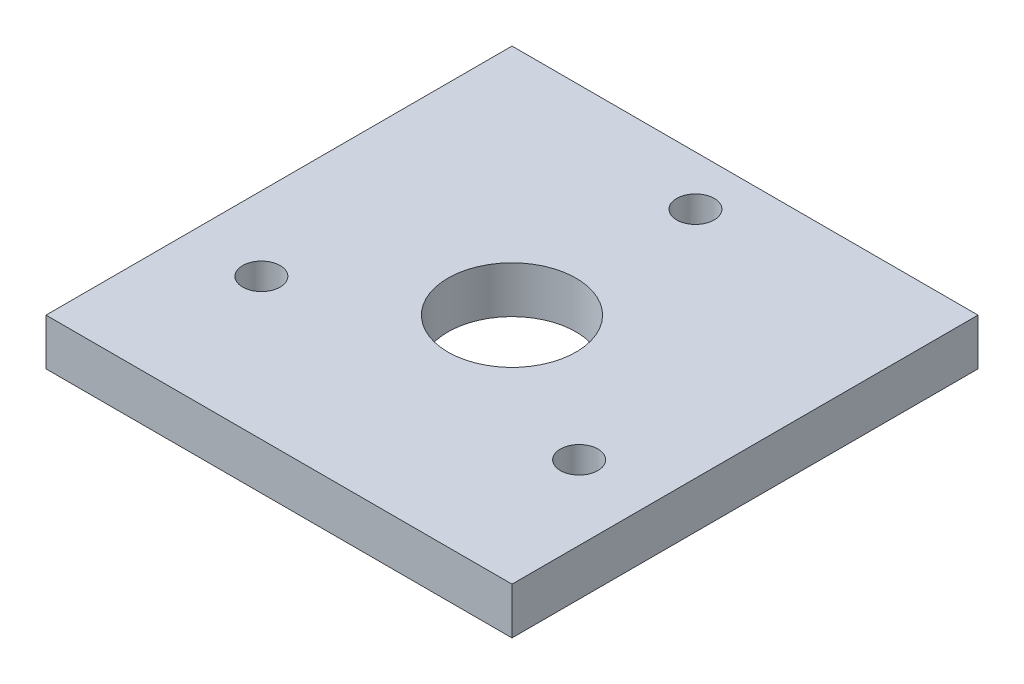
ISO-10303-21;
HEADER;
FILE_DESCRIPTION(('STEP AP214'),'2;1');
FILE_NAME('part.step','',(''),(''),'','','');
FILE_SCHEMA(('AUTOMOTIVE_DESIGN { 1 0 10303 214 1 1 1 1 }'));
ENDSEC;
DATA;
#1=APPLICATION_CONTEXT('core data for automotive mechanical design processes');
#2=APPLICATION_PROTOCOL_DEFINITION('international standard','automotive_design',2000,#1);
#3=PRODUCT_CONTEXT('',#1,'mechanical');
#4=PRODUCT('Part','Part','',(#3));
#5=PRODUCT_RELATED_PRODUCT_CATEGORY('part','',(#4));
#6=PRODUCT_DEFINITION_FORMATION('','',#4);
#7=PRODUCT_DEFINITION_CONTEXT('part definition',#1,'design');
#8=PRODUCT_DEFINITION('design','',#6,#7);
#9=PRODUCT_DEFINITION_SHAPE('','',#8);
#10=(LENGTH_UNIT() NAMED_UNIT(*) SI_UNIT(.MILLI.,.METRE.));
#11=(NAMED_UNIT(*) PLANE_ANGLE_UNIT() SI_UNIT($,.RADIAN.));
#12=(NAMED_UNIT(*) SI_UNIT($,.STERADIAN.) SOLID_ANGLE_UNIT());
#13=UNCERTAINTY_MEASURE_WITH_UNIT(LENGTH_MEASURE(1.E-05),#10,'distance_accuracy_value','');
#14=(GEOMETRIC_REPRESENTATION_CONTEXT(3) GLOBAL_UNCERTAINTY_ASSIGNED_CONTEXT((#13)) GLOBAL_UNIT_ASSIGNED_CONTEXT((#10,
#11,#12)) REPRESENTATION_CONTEXT('',''));
#15=CARTESIAN_POINT('',(0.,0.,0.));
#16=DIRECTION('',(0.,0.,1.));
#17=DIRECTION('',(1.,0.,0.));
#18=AXIS2_PLACEMENT_3D('',#15,#16,#17);
#19=CARTESIAN_POINT('',(0.,6.35,0.));
#20=DIRECTION('',(0.,1.,0.));
#21=DIRECTION('',(0.,0.,1.));
#22=AXIS2_PLACEMENT_3D('',#19,#20,#21);
#23=PLANE('',#22);
#24=CARTESIAN_POINT('',(21.6506350946126,6.35,12.4999999999991));
#25=DIRECTION('',(0.,1.,0.));
#26=DIRECTION('',(0.,0.,1.));
#27=AXIS2_PLACEMENT_3D('',#24,#25,#26);
#28=CIRCLE('',#27,2.55270000000138);
#29=CARTESIAN_POINT('',(21.6506350946126,6.35,15.0527000000005));
#30=VERTEX_POINT('',#29);
#31=EDGE_CURVE('E121',#30,#30,#28,.T.);
#32=ORIENTED_EDGE('',*,*,#31,.F.);
#33=EDGE_LOOP('',(#32));
#34=FACE_BOUND('',#33,.T.);
#35=CARTESIAN_POINT('',(0.,6.35,-25.));
#36=DIRECTION('',(0.,1.,0.));
#37=DIRECTION('',(0.,0.,1.));
#38=AXIS2_PLACEMENT_3D('',#35,#36,#37);
#39=CIRCLE('',#38,2.5527);
#40=CARTESIAN_POINT('',(0.,6.35,-22.4473));
#41=VERTEX_POINT('',#40);
#42=EDGE_CURVE('E100',#41,#41,#39,.T.);
#43=ORIENTED_EDGE('',*,*,#42,.F.);
#44=EDGE_LOOP('',(#43));
#45=FACE_BOUND('',#44,.T.);
#46=DIRECTION('',(0.,0.,1.));
#47=VECTOR('',#46,1.);
#48=CARTESIAN_POINT('',(-31.75,6.35,31.75));
#49=LINE('',#48,#47);
#50=CARTESIAN_POINT('',(-31.75,6.35,-31.75));
#51=VERTEX_POINT('',#50);
#52=CARTESIAN_POINT('',(-31.75,6.35,31.75));
#53=VERTEX_POINT('',#52);
#54=EDGE_CURVE('E85',#51,#53,#49,.T.);
#55=ORIENTED_EDGE('',*,*,#54,.T.);
#56=DIRECTION('',(1.,0.,0.));
#57=VECTOR('',#56,1.);
#58=CARTESIAN_POINT('',(31.75,6.35,31.75));
#59=LINE('',#58,#57);
#60=CARTESIAN_POINT('',(31.75,6.35,31.75));
#61=VERTEX_POINT('',#60);
#62=EDGE_CURVE('E80',#53,#61,#59,.T.);
#63=ORIENTED_EDGE('',*,*,#62,.T.);
#64=DIRECTION('',(0.,0.,-1.));
#65=VECTOR('',#64,1.);
#66=CARTESIAN_POINT('',(31.75,6.35,31.75));
#67=LINE('',#66,#65);
#68=CARTESIAN_POINT('',(31.75,6.35,-31.75));
#69=VERTEX_POINT('',#68);
#70=EDGE_CURVE('E83',#61,#69,#67,.T.);
#71=ORIENTED_EDGE('',*,*,#70,.T.);
#72=DIRECTION('',(-1.,0.,0.));
#73=VECTOR('',#72,1.);
#74=CARTESIAN_POINT('',(31.75,6.35,-31.75));
#75=LINE('',#74,#73);
#76=EDGE_CURVE('E50',#69,#51,#75,.T.);
#77=ORIENTED_EDGE('',*,*,#76,.T.);
#78=EDGE_LOOP('',(#55,#63,#71,#77));
#79=FACE_BOUND('',#78,.T.);
#80=CARTESIAN_POINT('',(0.,6.35,0.));
#81=DIRECTION('',(0.,1.,0.));
#82=DIRECTION('',(0.,0.,1.));
#83=AXIS2_PLACEMENT_3D('',#80,#81,#82);
#84=CIRCLE('',#83,8.73125);
#85=CARTESIAN_POINT('',(0.,6.35,8.73125000000001));
#86=VERTEX_POINT('',#85);
#87=EDGE_CURVE('E115',#86,#86,#84,.T.);
#88=ORIENTED_EDGE('',*,*,#87,.F.);
#89=EDGE_LOOP('',(#88));
#90=FACE_BOUND('',#89,.T.);
#91=CARTESIAN_POINT('',(-21.6506350946094,6.35,12.5000000000009));
#92=DIRECTION('',(0.,1.,0.));
#93=DIRECTION('',(0.,0.,1.));
#94=AXIS2_PLACEMENT_3D('',#91,#92,#93);
#95=CIRCLE('',#94,2.55270000000203);
#96=CARTESIAN_POINT('',(-21.6506350946094,6.35,15.052700000003));
#97=VERTEX_POINT('',#96);
#98=EDGE_CURVE('E127',#97,#97,#95,.T.);
#99=ORIENTED_EDGE('',*,*,#98,.F.);
#100=EDGE_LOOP('',(#99));
#101=FACE_BOUND('',#100,.T.);
#102=ADVANCED_FACE('F33',(#34,#45,#79,#90,#101),#23,.T.);
#103=CARTESIAN_POINT('',(0.,0.,0.));
#104=DIRECTION('',(0.,1.,0.));
#105=DIRECTION('',(0.,0.,1.));
#106=AXIS2_PLACEMENT_3D('',#103,#104,#105);
#107=PLANE('',#106);
#108=DIRECTION('',(0.,0.,1.));
#109=VECTOR('',#108,1.);
#110=CARTESIAN_POINT('',(-31.75,0.,31.75));
#111=LINE('',#110,#109);
#112=CARTESIAN_POINT('',(-31.75,0.,-31.75));
#113=VERTEX_POINT('',#112);
#114=CARTESIAN_POINT('',(-31.75,0.,31.75));
#115=VERTEX_POINT('',#114);
#116=EDGE_CURVE('E97',#113,#115,#111,.T.);
#117=ORIENTED_EDGE('',*,*,#116,.F.);
#118=DIRECTION('',(-1.,0.,0.));
#119=VECTOR('',#118,1.);
#120=CARTESIAN_POINT('',(31.75,0.,-31.75));
#121=LINE('',#120,#119);
#122=CARTESIAN_POINT('',(31.75,0.,-31.75));
#123=VERTEX_POINT('',#122);
#124=EDGE_CURVE('E73',#123,#113,#121,.T.);
#125=ORIENTED_EDGE('',*,*,#124,.F.);
#126=DIRECTION('',(0.,0.,-1.));
#127=VECTOR('',#126,1.);
#128=CARTESIAN_POINT('',(31.75,0.,31.75));
#129=LINE('',#128,#127);
#130=CARTESIAN_POINT('',(31.75,0.,31.75));
#131=VERTEX_POINT('',#130);
#132=EDGE_CURVE('E67',#131,#123,#129,.T.);
#133=ORIENTED_EDGE('',*,*,#132,.F.);
#134=DIRECTION('',(1.,0.,0.));
#135=VECTOR('',#134,1.);
#136=CARTESIAN_POINT('',(31.75,0.,31.75));
#137=LINE('',#136,#135);
#138=EDGE_CURVE('E89',#115,#131,#137,.T.);
#139=ORIENTED_EDGE('',*,*,#138,.F.);
#140=EDGE_LOOP('',(#117,#125,#133,#139));
#141=FACE_BOUND('',#140,.T.);
#142=CARTESIAN_POINT('',(0.,0.,-25.));
#143=DIRECTION('',(0.,1.,0.));
#144=DIRECTION('',(0.,0.,1.));
#145=AXIS2_PLACEMENT_3D('',#142,#143,#144);
#146=CIRCLE('',#145,2.5527);
#147=CARTESIAN_POINT('',(0.,0.,-22.4473));
#148=VERTEX_POINT('',#147);
#149=EDGE_CURVE('E112',#148,#148,#146,.T.);
#150=ORIENTED_EDGE('',*,*,#149,.T.);
#151=EDGE_LOOP('',(#150));
#152=FACE_BOUND('',#151,.T.);
#153=CARTESIAN_POINT('',(0.,0.,0.));
#154=DIRECTION('',(0.,1.,0.));
#155=DIRECTION('',(0.,0.,1.));
#156=AXIS2_PLACEMENT_3D('',#153,#154,#155);
#157=CIRCLE('',#156,8.73125);
#158=CARTESIAN_POINT('',(0.,0.,8.73125000000001));
#159=VERTEX_POINT('',#158);
#160=EDGE_CURVE('E118',#159,#159,#157,.T.);
#161=ORIENTED_EDGE('',*,*,#160,.T.);
#162=EDGE_LOOP('',(#161));
#163=FACE_BOUND('',#162,.T.);
#164=CARTESIAN_POINT('',(21.6506350946126,0.,12.4999999999991));
#165=DIRECTION('',(0.,1.,0.));
#166=DIRECTION('',(0.,0.,1.));
#167=AXIS2_PLACEMENT_3D('',#164,#165,#166);
#168=CIRCLE('',#167,2.55270000000138);
#169=CARTESIAN_POINT('',(21.6506350946126,0.,15.0527000000005));
#170=VERTEX_POINT('',#169);
#171=EDGE_CURVE('E124',#170,#170,#168,.T.);
#172=ORIENTED_EDGE('',*,*,#171,.T.);
#173=EDGE_LOOP('',(#172));
#174=FACE_BOUND('',#173,.T.);
#175=CARTESIAN_POINT('',(-21.6506350946094,0.,12.5000000000009));
#176=DIRECTION('',(0.,1.,0.));
#177=DIRECTION('',(0.,0.,1.));
#178=AXIS2_PLACEMENT_3D('',#175,#176,#177);
#179=CIRCLE('',#178,2.55270000000203);
#180=CARTESIAN_POINT('',(-21.6506350946094,0.,15.052700000003));
#181=VERTEX_POINT('',#180);
#182=EDGE_CURVE('E130',#181,#181,#179,.T.);
#183=ORIENTED_EDGE('',*,*,#182,.T.);
#184=EDGE_LOOP('',(#183));
#185=FACE_BOUND('',#184,.T.);
#186=ADVANCED_FACE('F108',(#141,#152,#163,#174,#185),#107,.F.);
#187=CARTESIAN_POINT('',(-31.75,6.35,31.75));
#188=DIRECTION('',(1.,0.,0.));
#189=DIRECTION('',(0.,0.,-1.));
#190=AXIS2_PLACEMENT_3D('',#187,#188,#189);
#191=PLANE('',#190);
#192=ORIENTED_EDGE('',*,*,#116,.T.);
#193=DIRECTION('',(0.,-1.,0.));
#194=VECTOR('',#193,1.);
#195=CARTESIAN_POINT('',(-31.75,6.35,31.75));
#196=LINE('',#195,#194);
#197=EDGE_CURVE('E11',#53,#115,#196,.T.);
#198=ORIENTED_EDGE('',*,*,#197,.F.);
#199=ORIENTED_EDGE('',*,*,#54,.F.);
#200=DIRECTION('',(0.,-1.,0.));
#201=VECTOR('',#200,1.);
#202=CARTESIAN_POINT('',(-31.75,6.35,-31.75));
#203=LINE('',#202,#201);
#204=EDGE_CURVE('E93',#51,#113,#203,.T.);
#205=ORIENTED_EDGE('',*,*,#204,.T.);
#206=EDGE_LOOP('',(#192,#198,#199,#205));
#207=FACE_BOUND('',#206,.T.);
#208=ADVANCED_FACE('F35',(#207),#191,.F.);
#209=CARTESIAN_POINT('',(31.75,6.35,31.75));
#210=DIRECTION('',(0.,0.,-1.));
#211=DIRECTION('',(-1.,0.,0.));
#212=AXIS2_PLACEMENT_3D('',#209,#210,#211);
#213=PLANE('',#212);
#214=ORIENTED_EDGE('',*,*,#138,.T.);
#215=DIRECTION('',(0.,-1.,0.));
#216=VECTOR('',#215,1.);
#217=CARTESIAN_POINT('',(31.75,6.35,31.75));
#218=LINE('',#217,#216);
#219=EDGE_CURVE('E42',#61,#131,#218,.T.);
#220=ORIENTED_EDGE('',*,*,#219,.F.);
#221=ORIENTED_EDGE('',*,*,#62,.F.);
#222=ORIENTED_EDGE('',*,*,#197,.T.);
#223=EDGE_LOOP('',(#214,#220,#221,#222));
#224=FACE_BOUND('',#223,.T.);
#225=ADVANCED_FACE('F88',(#224),#213,.F.);
#226=CARTESIAN_POINT('',(31.75,6.35,31.75));
#227=DIRECTION('',(-1.,0.,0.));
#228=DIRECTION('',(0.,0.,1.));
#229=AXIS2_PLACEMENT_3D('',#226,#227,#228);
#230=PLANE('',#229);
#231=ORIENTED_EDGE('',*,*,#132,.T.);
#232=DIRECTION('',(0.,-1.,0.));
#233=VECTOR('',#232,1.);
#234=CARTESIAN_POINT('',(31.75,6.35,-31.75));
#235=LINE('',#234,#233);
#236=EDGE_CURVE('E90',#69,#123,#235,.T.);
#237=ORIENTED_EDGE('',*,*,#236,.F.);
#238=ORIENTED_EDGE('',*,*,#70,.F.);
#239=ORIENTED_EDGE('',*,*,#219,.T.);
#240=EDGE_LOOP('',(#231,#237,#238,#239));
#241=FACE_BOUND('',#240,.T.);
#242=ADVANCED_FACE('F91',(#241),#230,.F.);
#243=CARTESIAN_POINT('',(31.75,6.35,-31.75));
#244=DIRECTION('',(0.,0.,1.));
#245=DIRECTION('',(1.,0.,0.));
#246=AXIS2_PLACEMENT_3D('',#243,#244,#245);
#247=PLANE('',#246);
#248=ORIENTED_EDGE('',*,*,#124,.T.);
#249=ORIENTED_EDGE('',*,*,#204,.F.);
#250=ORIENTED_EDGE('',*,*,#76,.F.);
#251=ORIENTED_EDGE('',*,*,#236,.T.);
#252=EDGE_LOOP('',(#248,#249,#250,#251));
#253=FACE_BOUND('',#252,.T.);
#254=ADVANCED_FACE('F105',(#253),#247,.F.);
#255=CARTESIAN_POINT('',(0.,6.35,-25.));
#256=DIRECTION('',(0.,-1.,0.));
#257=DIRECTION('',(0.,0.,-1.));
#258=AXIS2_PLACEMENT_3D('',#255,#256,#257);
#259=CYLINDRICAL_SURFACE('',#258,2.5527);
#260=ORIENTED_EDGE('',*,*,#42,.T.);
#261=EDGE_LOOP('',(#260));
#262=FACE_BOUND('',#261,.T.);
#263=ORIENTED_EDGE('',*,*,#149,.F.);
#264=EDGE_LOOP('',(#263));
#265=FACE_BOUND('',#264,.T.);
#266=ADVANCED_FACE('F149',(#262,#265),#259,.F.);
#267=CARTESIAN_POINT('',(0.,6.35,0.));
#268=DIRECTION('',(0.,-1.,0.));
#269=DIRECTION('',(0.,0.,-1.));
#270=AXIS2_PLACEMENT_3D('',#267,#268,#269);
#271=CYLINDRICAL_SURFACE('',#270,8.73125);
#272=ORIENTED_EDGE('',*,*,#87,.T.);
#273=EDGE_LOOP('',(#272));
#274=FACE_BOUND('',#273,.T.);
#275=ORIENTED_EDGE('',*,*,#160,.F.);
#276=EDGE_LOOP('',(#275));
#277=FACE_BOUND('',#276,.T.);
#278=ADVANCED_FACE('F195',(#274,#277),#271,.F.);
#279=CARTESIAN_POINT('',(21.6506350946126,6.35,12.4999999999991));
#280=DIRECTION('',(0.,-1.,0.));
#281=DIRECTION('',(0.,0.,-1.));
#282=AXIS2_PLACEMENT_3D('',#279,#280,#281);
#283=CYLINDRICAL_SURFACE('',#282,2.55270000000138);
#284=ORIENTED_EDGE('',*,*,#31,.T.);
#285=EDGE_LOOP('',(#284));
#286=FACE_BOUND('',#285,.T.);
#287=ORIENTED_EDGE('',*,*,#171,.F.);
#288=EDGE_LOOP('',(#287));
#289=FACE_BOUND('',#288,.T.);
#290=ADVANCED_FACE('F203',(#286,#289),#283,.F.);
#291=CARTESIAN_POINT('',(-21.6506350946094,6.35,12.5000000000009));
#292=DIRECTION('',(0.,-1.,0.));
#293=DIRECTION('',(0.,0.,-1.));
#294=AXIS2_PLACEMENT_3D('',#291,#292,#293);
#295=CYLINDRICAL_SURFACE('',#294,2.55270000000203);
#296=ORIENTED_EDGE('',*,*,#98,.T.);
#297=EDGE_LOOP('',(#296));
#298=FACE_BOUND('',#297,.T.);
#299=ORIENTED_EDGE('',*,*,#182,.F.);
#300=EDGE_LOOP('',(#299));
#301=FACE_BOUND('',#300,.T.);
#302=ADVANCED_FACE('F136',(#298,#301),#295,.F.);
#303=CLOSED_SHELL('',(#102,#186,#208,#225,#242,#254,#266,#278,#290,#302));
#304=MANIFOLD_SOLID_BREP('B2',#303);
#305=ADVANCED_BREP_SHAPE_REPRESENTATION('',(#18,#304),#14);
#306=SHAPE_DEFINITION_REPRESENTATION(#9,#305);
ENDSEC;
END-ISO-10303-21;
